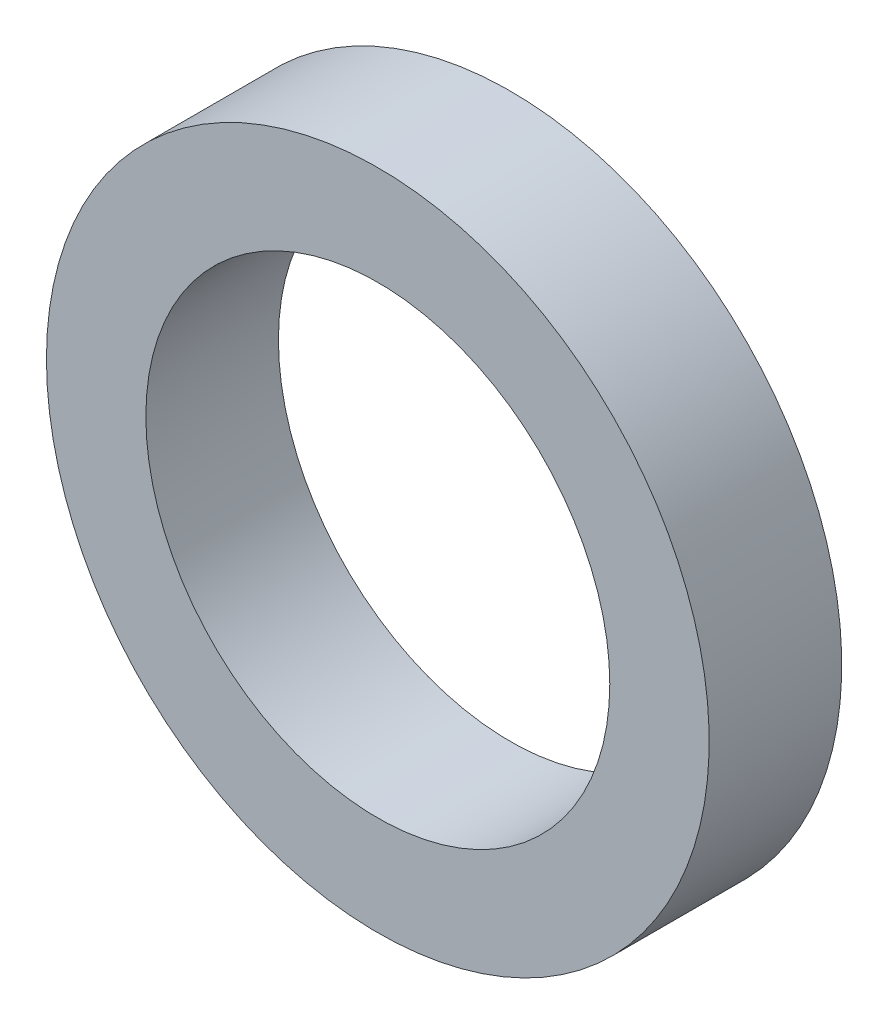
ISO-10303-21;
HEADER;
FILE_DESCRIPTION(('STEP AP214'),'2;1');
FILE_NAME('part.step','',(''),(''),'','','');
FILE_SCHEMA(('AUTOMOTIVE_DESIGN { 1 0 10303 214 1 1 1 1 }'));
ENDSEC;
DATA;
#1=APPLICATION_CONTEXT('core data for automotive mechanical design processes');
#2=APPLICATION_PROTOCOL_DEFINITION('international standard','automotive_design',2000,#1);
#3=PRODUCT_CONTEXT('',#1,'mechanical');
#4=PRODUCT('Part','Part','',(#3));
#5=PRODUCT_RELATED_PRODUCT_CATEGORY('part','',(#4));
#6=PRODUCT_DEFINITION_FORMATION('','',#4);
#7=PRODUCT_DEFINITION_CONTEXT('part definition',#1,'design');
#8=PRODUCT_DEFINITION('design','',#6,#7);
#9=PRODUCT_DEFINITION_SHAPE('','',#8);
#10=(LENGTH_UNIT() NAMED_UNIT(*) SI_UNIT(.MILLI.,.METRE.));
#11=(NAMED_UNIT(*) PLANE_ANGLE_UNIT() SI_UNIT($,.RADIAN.));
#12=(NAMED_UNIT(*) SI_UNIT($,.STERADIAN.) SOLID_ANGLE_UNIT());
#13=UNCERTAINTY_MEASURE_WITH_UNIT(LENGTH_MEASURE(1.E-05),#10,'distance_accuracy_value','');
#14=(GEOMETRIC_REPRESENTATION_CONTEXT(3) GLOBAL_UNCERTAINTY_ASSIGNED_CONTEXT((#13)) GLOBAL_UNIT_ASSIGNED_CONTEXT((#10,
#11,#12)) REPRESENTATION_CONTEXT('',''));
#15=CARTESIAN_POINT('',(0.,0.,0.));
#16=DIRECTION('',(0.,0.,1.));
#17=DIRECTION('',(1.,0.,0.));
#18=AXIS2_PLACEMENT_3D('',#15,#16,#17);
#19=CARTESIAN_POINT('',(0.,0.,-1.5875));
#20=DIRECTION('',(0.,0.,1.));
#21=DIRECTION('',(1.,0.,0.));
#22=AXIS2_PLACEMENT_3D('',#19,#20,#21);
#23=PLANE('',#22);
#24=CARTESIAN_POINT('',(0.,0.,-1.5875));
#25=DIRECTION('',(0.,0.,-1.));
#26=DIRECTION('',(-1.,0.,0.));
#27=AXIS2_PLACEMENT_3D('',#24,#25,#26);
#28=CIRCLE('',#27,5.55625);
#29=CARTESIAN_POINT('',(-5.55625,0.,-1.5875));
#30=VERTEX_POINT('',#29);
#31=EDGE_CURVE('E26',#30,#30,#28,.F.);
#32=ORIENTED_EDGE('',*,*,#31,.T.);
#33=EDGE_LOOP('',(#32));
#34=FACE_BOUND('',#33,.T.);
#35=CARTESIAN_POINT('',(0.,0.,-1.5875));
#36=DIRECTION('',(0.,0.,-1.));
#37=DIRECTION('',(-1.,0.,0.));
#38=AXIS2_PLACEMENT_3D('',#35,#36,#37);
#39=CIRCLE('',#38,7.9375);
#40=CARTESIAN_POINT('',(-7.9375,0.,-1.5875));
#41=VERTEX_POINT('',#40);
#42=EDGE_CURVE('E17',#41,#41,#39,.F.);
#43=ORIENTED_EDGE('',*,*,#42,.F.);
#44=EDGE_LOOP('',(#43));
#45=FACE_BOUND('',#44,.T.);
#46=ADVANCED_FACE('F14',(#34,#45),#23,.F.);
#47=CARTESIAN_POINT('',(0.,0.,1.5875));
#48=DIRECTION('',(0.,0.,-1.));
#49=DIRECTION('',(-1.,0.,0.));
#50=AXIS2_PLACEMENT_3D('',#47,#48,#49);
#51=CYLINDRICAL_SURFACE('',#50,7.9375);
#52=ORIENTED_EDGE('',*,*,#42,.T.);
#53=EDGE_LOOP('',(#52));
#54=FACE_BOUND('',#53,.T.);
#55=CARTESIAN_POINT('',(0.,0.,1.5875));
#56=DIRECTION('',(0.,0.,-1.));
#57=DIRECTION('',(-1.,0.,0.));
#58=AXIS2_PLACEMENT_3D('',#55,#56,#57);
#59=CIRCLE('',#58,7.9375);
#60=CARTESIAN_POINT('',(-7.9375,0.,1.5875));
#61=VERTEX_POINT('',#60);
#62=EDGE_CURVE('E21',#61,#61,#59,.F.);
#63=ORIENTED_EDGE('',*,*,#62,.F.);
#64=EDGE_LOOP('',(#63));
#65=FACE_BOUND('',#64,.T.);
#66=ADVANCED_FACE('F34',(#54,#65),#51,.T.);
#67=CARTESIAN_POINT('',(0.,0.,1.5875));
#68=DIRECTION('',(0.,0.,-1.));
#69=DIRECTION('',(-1.,0.,0.));
#70=AXIS2_PLACEMENT_3D('',#67,#68,#69);
#71=CYLINDRICAL_SURFACE('',#70,5.55625);
#72=CARTESIAN_POINT('',(0.,0.,1.5875));
#73=DIRECTION('',(0.,0.,-1.));
#74=DIRECTION('',(-1.,0.,0.));
#75=AXIS2_PLACEMENT_3D('',#72,#73,#74);
#76=CIRCLE('',#75,5.55625);
#77=CARTESIAN_POINT('',(-5.55625,0.,1.5875));
#78=VERTEX_POINT('',#77);
#79=EDGE_CURVE('E10',#78,#78,#76,.T.);
#80=ORIENTED_EDGE('',*,*,#79,.F.);
#81=EDGE_LOOP('',(#80));
#82=FACE_BOUND('',#81,.T.);
#83=ORIENTED_EDGE('',*,*,#31,.F.);
#84=EDGE_LOOP('',(#83));
#85=FACE_BOUND('',#84,.T.);
#86=ADVANCED_FACE('F42',(#82,#85),#71,.F.);
#87=CARTESIAN_POINT('',(0.,0.,1.5875));
#88=DIRECTION('',(0.,0.,1.));
#89=DIRECTION('',(1.,0.,0.));
#90=AXIS2_PLACEMENT_3D('',#87,#88,#89);
#91=PLANE('',#90);
#92=ORIENTED_EDGE('',*,*,#79,.T.);
#93=EDGE_LOOP('',(#92));
#94=FACE_BOUND('',#93,.T.);
#95=ORIENTED_EDGE('',*,*,#62,.T.);
#96=EDGE_LOOP('',(#95));
#97=FACE_BOUND('',#96,.T.);
#98=ADVANCED_FACE('F43',(#94,#97),#91,.T.);
#99=CLOSED_SHELL('',(#46,#66,#86,#98));
#100=MANIFOLD_SOLID_BREP('B1',#99);
#101=ADVANCED_BREP_SHAPE_REPRESENTATION('',(#18,#100),#14);
#102=SHAPE_DEFINITION_REPRESENTATION(#9,#101);
ENDSEC;
END-ISO-10303-21;
